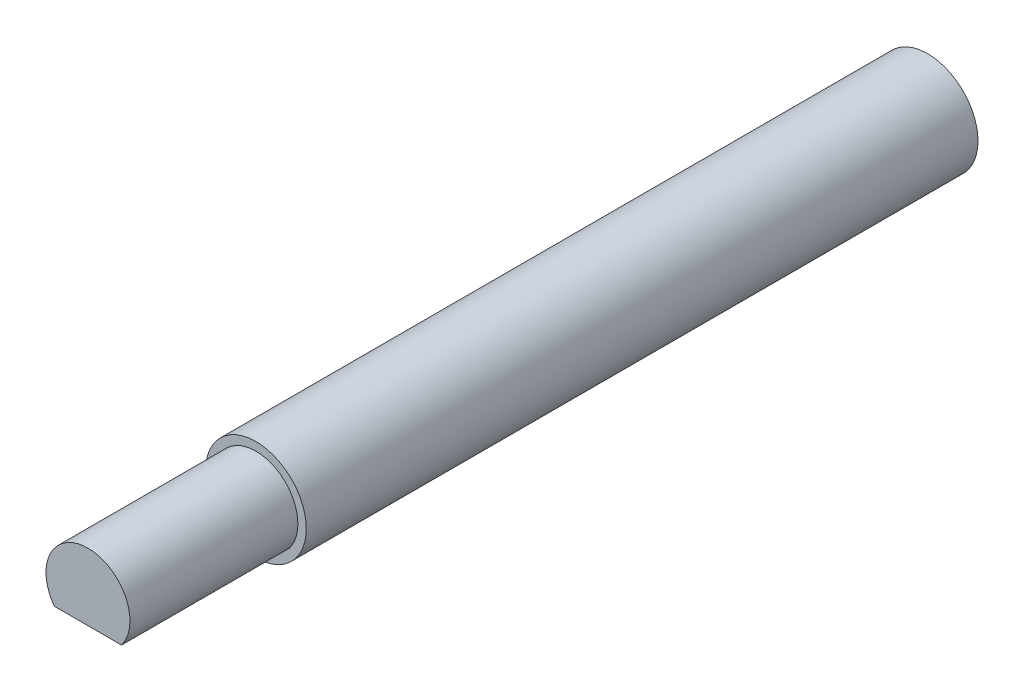
ISO-10303-21;
HEADER;
FILE_DESCRIPTION(('STEP AP214'),'2;1');
FILE_NAME('part.step','',(''),(''),'','','');
FILE_SCHEMA(('AUTOMOTIVE_DESIGN { 1 0 10303 214 1 1 1 1 }'));
ENDSEC;
DATA;
#1=APPLICATION_CONTEXT('core data for automotive mechanical design processes');
#2=APPLICATION_PROTOCOL_DEFINITION('international standard','automotive_design',2000,#1);
#3=PRODUCT_CONTEXT('',#1,'mechanical');
#4=PRODUCT('Part','Part','',(#3));
#5=PRODUCT_RELATED_PRODUCT_CATEGORY('part','',(#4));
#6=PRODUCT_DEFINITION_FORMATION('','',#4);
#7=PRODUCT_DEFINITION_CONTEXT('part definition',#1,'design');
#8=PRODUCT_DEFINITION('design','',#6,#7);
#9=PRODUCT_DEFINITION_SHAPE('','',#8);
#10=(LENGTH_UNIT() NAMED_UNIT(*) SI_UNIT(.MILLI.,.METRE.));
#11=(NAMED_UNIT(*) PLANE_ANGLE_UNIT() SI_UNIT($,.RADIAN.));
#12=(NAMED_UNIT(*) SI_UNIT($,.STERADIAN.) SOLID_ANGLE_UNIT());
#13=UNCERTAINTY_MEASURE_WITH_UNIT(LENGTH_MEASURE(1.E-05),#10,'distance_accuracy_value','');
#14=(GEOMETRIC_REPRESENTATION_CONTEXT(3) GLOBAL_UNCERTAINTY_ASSIGNED_CONTEXT((#13)) GLOBAL_UNIT_ASSIGNED_CONTEXT((#10,
#11,#12)) REPRESENTATION_CONTEXT('',''));
#15=CARTESIAN_POINT('',(0.,0.,0.));
#16=DIRECTION('',(0.,0.,1.));
#17=DIRECTION('',(1.,0.,0.));
#18=AXIS2_PLACEMENT_3D('',#15,#16,#17);
#19=CARTESIAN_POINT('',(0.,0.,80.));
#20=DIRECTION('',(0.,0.,-1.));
#21=DIRECTION('',(-1.,0.,0.));
#22=AXIS2_PLACEMENT_3D('',#19,#20,#21);
#23=CYLINDRICAL_SURFACE('',#22,6.);
#24=CARTESIAN_POINT('',(0.,0.,80.));
#25=DIRECTION('',(0.,0.,1.));
#26=DIRECTION('',(1.,0.,0.));
#27=AXIS2_PLACEMENT_3D('',#24,#25,#26);
#28=CIRCLE('',#27,6.);
#29=CARTESIAN_POINT('',(6.,0.,80.));
#30=VERTEX_POINT('',#29);
#31=EDGE_CURVE('E11',#30,#30,#28,.T.);
#32=ORIENTED_EDGE('',*,*,#31,.F.);
#33=EDGE_LOOP('',(#32));
#34=FACE_BOUND('',#33,.T.);
#35=CARTESIAN_POINT('',(0.,0.,0.));
#36=DIRECTION('',(0.,0.,1.));
#37=DIRECTION('',(1.,0.,0.));
#38=AXIS2_PLACEMENT_3D('',#35,#36,#37);
#39=CIRCLE('',#38,6.);
#40=CARTESIAN_POINT('',(6.,0.,0.));
#41=VERTEX_POINT('',#40);
#42=EDGE_CURVE('E46',#41,#41,#39,.T.);
#43=ORIENTED_EDGE('',*,*,#42,.T.);
#44=EDGE_LOOP('',(#43));
#45=FACE_BOUND('',#44,.T.);
#46=ADVANCED_FACE('F43',(#34,#45),#23,.T.);
#47=CARTESIAN_POINT('',(0.,0.,80.));
#48=DIRECTION('',(0.,0.,1.));
#49=DIRECTION('',(1.,0.,0.));
#50=AXIS2_PLACEMENT_3D('',#47,#48,#49);
#51=PLANE('',#50);
#52=CARTESIAN_POINT('',(0.,0.,80.));
#53=DIRECTION('',(0.,0.,1.));
#54=DIRECTION('',(1.,0.,0.));
#55=AXIS2_PLACEMENT_3D('',#52,#53,#54);
#56=CIRCLE('',#55,5.);
#57=CARTESIAN_POINT('',(4.,-3.,80.));
#58=VERTEX_POINT('',#57);
#59=CARTESIAN_POINT('',(-4.,-3.,80.));
#60=VERTEX_POINT('',#59);
#61=EDGE_CURVE('E70',#58,#60,#56,.T.);
#62=ORIENTED_EDGE('',*,*,#61,.F.);
#63=DIRECTION('',(1.,0.,0.));
#64=VECTOR('',#63,1.);
#65=CARTESIAN_POINT('',(1.60092779594597,-3.,80.));
#66=LINE('',#65,#64);
#67=EDGE_CURVE('E57',#60,#58,#66,.T.);
#68=ORIENTED_EDGE('',*,*,#67,.F.);
#69=EDGE_LOOP('',(#62,#68));
#70=FACE_BOUND('',#69,.T.);
#71=ORIENTED_EDGE('',*,*,#31,.T.);
#72=EDGE_LOOP('',(#71));
#73=FACE_BOUND('',#72,.T.);
#74=ADVANCED_FACE('F71',(#70,#73),#51,.T.);
#75=CARTESIAN_POINT('',(0.,0.,0.));
#76=DIRECTION('',(0.,0.,1.));
#77=DIRECTION('',(1.,0.,0.));
#78=AXIS2_PLACEMENT_3D('',#75,#76,#77);
#79=PLANE('',#78);
#80=ORIENTED_EDGE('',*,*,#42,.F.);
#81=EDGE_LOOP('',(#80));
#82=FACE_BOUND('',#81,.T.);
#83=ADVANCED_FACE('F107',(#82),#79,.F.);
#84=CARTESIAN_POINT('',(0.,0.,100.));
#85=DIRECTION('',(0.,0.,-1.));
#86=DIRECTION('',(-1.,0.,0.));
#87=AXIS2_PLACEMENT_3D('',#84,#85,#86);
#88=CYLINDRICAL_SURFACE('',#87,5.);
#89=ORIENTED_EDGE('',*,*,#61,.T.);
#90=DIRECTION('',(0.,0.,-1.));
#91=VECTOR('',#90,1.);
#92=CARTESIAN_POINT('',(-4.,-3.,100.));
#93=LINE('',#92,#91);
#94=CARTESIAN_POINT('',(-4.,-3.,100.));
#95=VERTEX_POINT('',#94);
#96=EDGE_CURVE('E82',#95,#60,#93,.T.);
#97=ORIENTED_EDGE('',*,*,#96,.F.);
#98=CARTESIAN_POINT('',(0.,0.,100.));
#99=DIRECTION('',(0.,0.,1.));
#100=DIRECTION('',(1.,0.,0.));
#101=AXIS2_PLACEMENT_3D('',#98,#99,#100);
#102=CIRCLE('',#101,5.);
#103=CARTESIAN_POINT('',(4.,-3.,100.));
#104=VERTEX_POINT('',#103);
#105=EDGE_CURVE('E84',#104,#95,#102,.T.);
#106=ORIENTED_EDGE('',*,*,#105,.F.);
#107=DIRECTION('',(0.,0.,-1.));
#108=VECTOR('',#107,1.);
#109=CARTESIAN_POINT('',(4.,-3.,100.));
#110=LINE('',#109,#108);
#111=EDGE_CURVE('E80',#104,#58,#110,.T.);
#112=ORIENTED_EDGE('',*,*,#111,.T.);
#113=EDGE_LOOP('',(#89,#97,#106,#112));
#114=FACE_BOUND('',#113,.T.);
#115=ADVANCED_FACE('F86',(#114),#88,.T.);
#116=CARTESIAN_POINT('',(1.60092779594597,-3.,100.));
#117=DIRECTION('',(0.,1.,0.));
#118=DIRECTION('',(-1.,0.,0.));
#119=AXIS2_PLACEMENT_3D('',#116,#117,#118);
#120=PLANE('',#119);
#121=ORIENTED_EDGE('',*,*,#67,.T.);
#122=ORIENTED_EDGE('',*,*,#111,.F.);
#123=DIRECTION('',(1.,0.,0.));
#124=VECTOR('',#123,1.);
#125=CARTESIAN_POINT('',(-4.,-3.,100.));
#126=LINE('',#125,#124);
#127=EDGE_CURVE('E65',#95,#104,#126,.T.);
#128=ORIENTED_EDGE('',*,*,#127,.F.);
#129=ORIENTED_EDGE('',*,*,#96,.T.);
#130=EDGE_LOOP('',(#121,#122,#128,#129));
#131=FACE_BOUND('',#130,.T.);
#132=ADVANCED_FACE('F79',(#131),#120,.F.);
#133=CARTESIAN_POINT('',(0.,0.,100.));
#134=DIRECTION('',(0.,0.,1.));
#135=DIRECTION('',(1.,0.,0.));
#136=AXIS2_PLACEMENT_3D('',#133,#134,#135);
#137=PLANE('',#136);
#138=ORIENTED_EDGE('',*,*,#105,.T.);
#139=ORIENTED_EDGE('',*,*,#127,.T.);
#140=EDGE_LOOP('',(#138,#139));
#141=FACE_BOUND('',#140,.T.);
#142=ADVANCED_FACE('F95',(#141),#137,.T.);
#143=CLOSED_SHELL('',(#46,#74,#83,#115,#132,#142));
#144=MANIFOLD_SOLID_BREP('B2',#143);
#145=ADVANCED_BREP_SHAPE_REPRESENTATION('',(#18,#144),#14);
#146=SHAPE_DEFINITION_REPRESENTATION(#9,#145);
ENDSEC;
END-ISO-10303-21;
